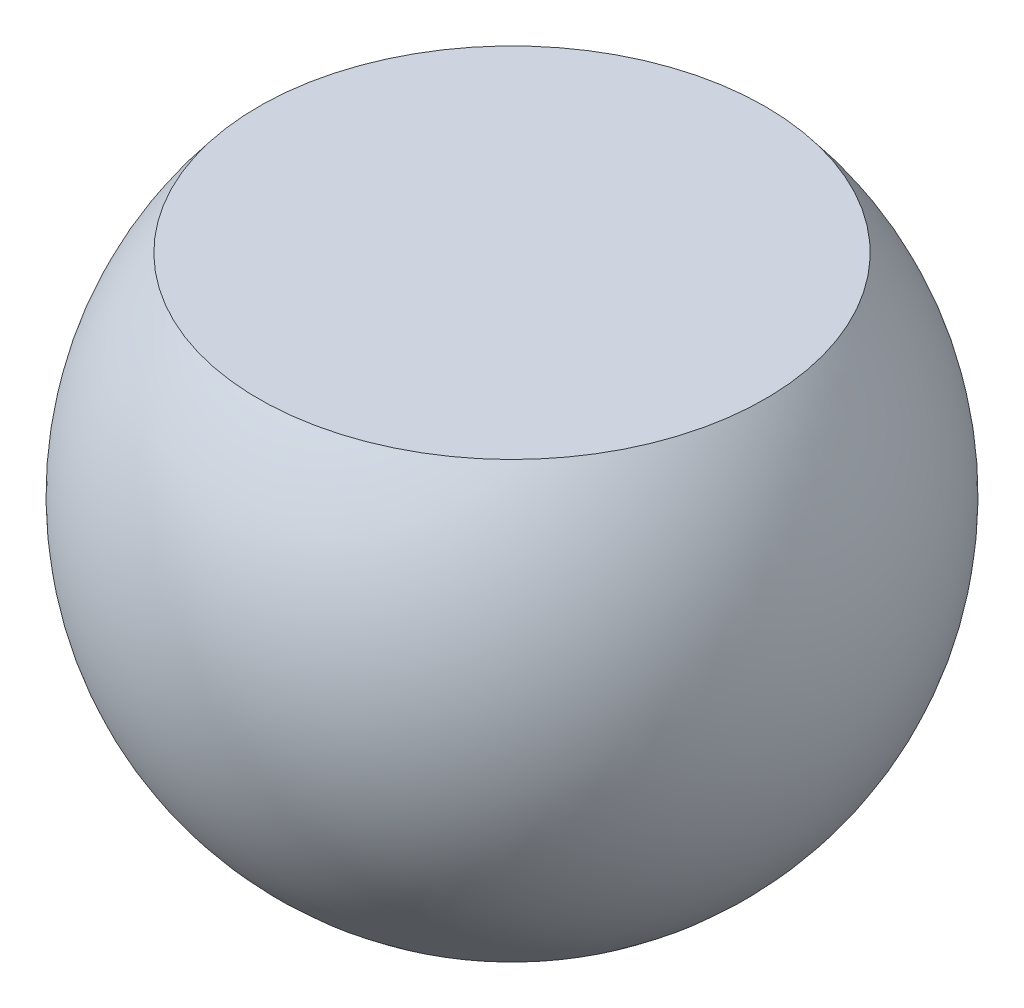
ISO-10303-21;
HEADER;
FILE_DESCRIPTION(('STEP AP214'),'2;1');
FILE_NAME('part.step','',(''),(''),'','','');
FILE_SCHEMA(('AUTOMOTIVE_DESIGN { 1 0 10303 214 1 1 1 1 }'));
ENDSEC;
DATA;
#1=APPLICATION_CONTEXT('core data for automotive mechanical design processes');
#2=APPLICATION_PROTOCOL_DEFINITION('international standard','automotive_design',2000,#1);
#3=PRODUCT_CONTEXT('',#1,'mechanical');
#4=PRODUCT('Part','Part','',(#3));
#5=PRODUCT_RELATED_PRODUCT_CATEGORY('part','',(#4));
#6=PRODUCT_DEFINITION_FORMATION('','',#4);
#7=PRODUCT_DEFINITION_CONTEXT('part definition',#1,'design');
#8=PRODUCT_DEFINITION('design','',#6,#7);
#9=PRODUCT_DEFINITION_SHAPE('','',#8);
#10=(LENGTH_UNIT() NAMED_UNIT(*) SI_UNIT(.MILLI.,.METRE.));
#11=(NAMED_UNIT(*) PLANE_ANGLE_UNIT() SI_UNIT($,.RADIAN.));
#12=(NAMED_UNIT(*) SI_UNIT($,.STERADIAN.) SOLID_ANGLE_UNIT());
#13=UNCERTAINTY_MEASURE_WITH_UNIT(LENGTH_MEASURE(1.E-05),#10,'distance_accuracy_value','');
#14=(GEOMETRIC_REPRESENTATION_CONTEXT(3) GLOBAL_UNCERTAINTY_ASSIGNED_CONTEXT((#13)) GLOBAL_UNIT_ASSIGNED_CONTEXT((#10,
#11,#12)) REPRESENTATION_CONTEXT('',''));
#15=CARTESIAN_POINT('',(0.,0.,0.));
#16=DIRECTION('',(0.,0.,1.));
#17=DIRECTION('',(1.,0.,0.));
#18=AXIS2_PLACEMENT_3D('',#15,#16,#17);
#19=CARTESIAN_POINT('',(0.,0.,0.));
#20=DIRECTION('',(0.,0.,-1.));
#21=DIRECTION('',(1.,0.,0.));
#22=AXIS2_PLACEMENT_3D('',#19,#20,#21);
#23=SPHERICAL_SURFACE('',#22,3.37);
#24=CARTESIAN_POINT('',(0.,0.,0.));
#25=DIRECTION('',(0.,-1.,0.));
#26=DIRECTION('',(0.,0.,-1.));
#27=AXIS2_PLACEMENT_3D('',#24,#25,#26);
#28=SPHERICAL_SURFACE('',#27,3.37);
#29=CARTESIAN_POINT('',(0.,2.156000006,0.));
#30=DIRECTION('',(0.,-1.,0.));
#31=DIRECTION('',(0.,0.,-1.));
#32=AXIS2_PLACEMENT_3D('',#29,#30,#31);
#33=CIRCLE('',#32,2.59008956874623);
#34=CARTESIAN_POINT('',(0.,2.156000006,-2.59008956874623));
#35=VERTEX_POINT('',#34);
#36=EDGE_CURVE('E10',#35,#35,#33,.F.);
#37=ORIENTED_EDGE('',*,*,#36,.F.);
#38=EDGE_LOOP('',(#37));
#39=FACE_BOUND('',#38,.T.);
#40=ADVANCED_FACE('F37',(#39),#28,.T.);
#41=CARTESIAN_POINT('',(0.,2.156000006,0.));
#42=DIRECTION('',(0.,-1.,0.));
#43=DIRECTION('',(0.,0.,-1.));
#44=AXIS2_PLACEMENT_3D('',#41,#42,#43);
#45=PLANE('',#44);
#46=ORIENTED_EDGE('',*,*,#36,.T.);
#47=EDGE_LOOP('',(#46));
#48=FACE_BOUND('',#47,.T.);
#49=ADVANCED_FACE('F44',(#48),#45,.F.);
#50=CLOSED_SHELL('',(#40,#49));
#51=MANIFOLD_SOLID_BREP('B2',#50);
#52=ADVANCED_BREP_SHAPE_REPRESENTATION('',(#18,#51),#14);
#53=SHAPE_DEFINITION_REPRESENTATION(#9,#52);
ENDSEC;
END-ISO-10303-21;
